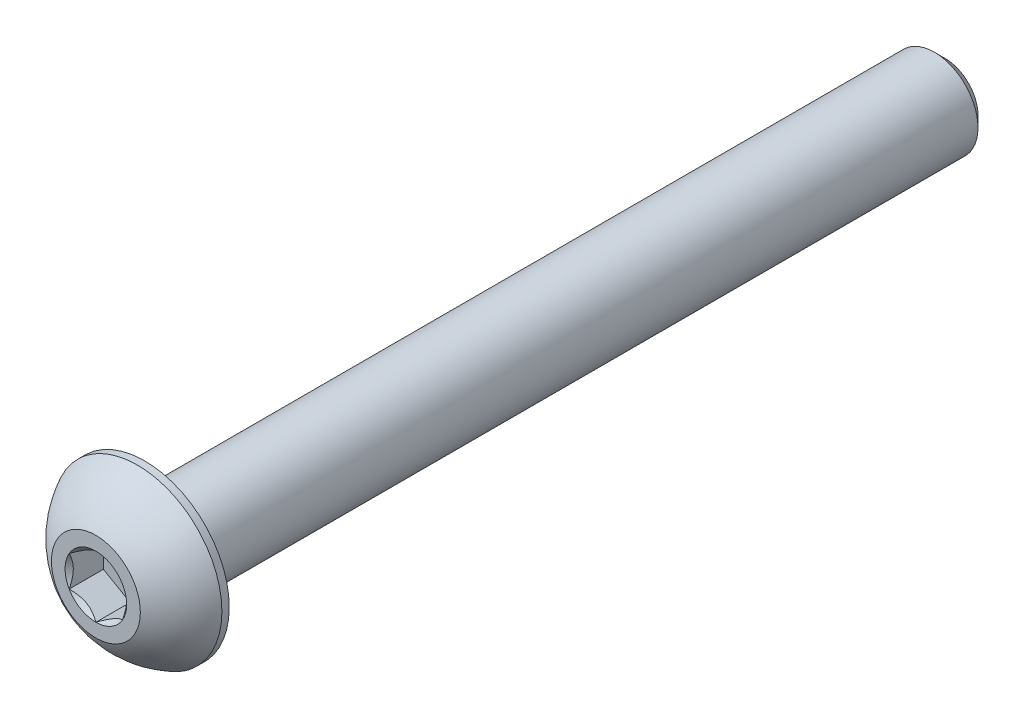
ISO-10303-21;
HEADER;
FILE_DESCRIPTION(('STEP AP214'),'2;1');
FILE_NAME('part.step','',(''),(''),'','','');
FILE_SCHEMA(('AUTOMOTIVE_DESIGN { 1 0 10303 214 1 1 1 1 }'));
ENDSEC;
DATA;
#1=APPLICATION_CONTEXT('core data for automotive mechanical design processes');
#2=APPLICATION_PROTOCOL_DEFINITION('international standard','automotive_design',2000,#1);
#3=PRODUCT_CONTEXT('',#1,'mechanical');
#4=PRODUCT('Part','Part','',(#3));
#5=PRODUCT_RELATED_PRODUCT_CATEGORY('part','',(#4));
#6=PRODUCT_DEFINITION_FORMATION('','',#4);
#7=PRODUCT_DEFINITION_CONTEXT('part definition',#1,'design');
#8=PRODUCT_DEFINITION('design','',#6,#7);
#9=PRODUCT_DEFINITION_SHAPE('','',#8);
#10=(LENGTH_UNIT() NAMED_UNIT(*) SI_UNIT(.MILLI.,.METRE.));
#11=(NAMED_UNIT(*) PLANE_ANGLE_UNIT() SI_UNIT($,.RADIAN.));
#12=(NAMED_UNIT(*) SI_UNIT($,.STERADIAN.) SOLID_ANGLE_UNIT());
#13=UNCERTAINTY_MEASURE_WITH_UNIT(LENGTH_MEASURE(1.E-05),#10,'distance_accuracy_value','');
#14=(GEOMETRIC_REPRESENTATION_CONTEXT(3) GLOBAL_UNCERTAINTY_ASSIGNED_CONTEXT((#13)) GLOBAL_UNIT_ASSIGNED_CONTEXT((#10,
#11,#12)) REPRESENTATION_CONTEXT('',''));
#15=CARTESIAN_POINT('',(0.,0.,0.));
#16=DIRECTION('',(0.,0.,1.));
#17=DIRECTION('',(1.,0.,0.));
#18=AXIS2_PLACEMENT_3D('',#15,#16,#17);
#19=CARTESIAN_POINT('',(1.5,-0.866025403784438,-1.925));
#20=DIRECTION('',(0.,0.,1.));
#21=DIRECTION('',(1.,0.,0.));
#22=AXIS2_PLACEMENT_3D('',#19,#20,#21);
#23=PLANE('',#22);
#24=DIRECTION('',(0.,-1.,0.));
#25=VECTOR('',#24,1.);
#26=CARTESIAN_POINT('',(-1.5,0.866025403784438,-1.925));
#27=LINE('',#26,#25);
#28=CARTESIAN_POINT('',(-1.5,0.866025403784438,-1.925));
#29=VERTEX_POINT('',#28);
#30=CARTESIAN_POINT('',(-1.5,-0.866025403784438,-1.925));
#31=VERTEX_POINT('',#30);
#32=EDGE_CURVE('E67',#29,#31,#27,.T.);
#33=ORIENTED_EDGE('',*,*,#32,.T.);
#34=DIRECTION('',(0.866025403784439,-0.5,0.));
#35=VECTOR('',#34,1.);
#36=CARTESIAN_POINT('',(-1.5,-0.866025403784438,-1.925));
#37=LINE('',#36,#35);
#38=CARTESIAN_POINT('',(0.,-1.73205080756888,-1.925));
#39=VERTEX_POINT('',#38);
#40=EDGE_CURVE('E81',#31,#39,#37,.T.);
#41=ORIENTED_EDGE('',*,*,#40,.T.);
#42=DIRECTION('',(0.866025403784438,0.5,0.));
#43=VECTOR('',#42,1.);
#44=CARTESIAN_POINT('',(0.,-1.73205080756888,-1.925));
#45=LINE('',#44,#43);
#46=CARTESIAN_POINT('',(1.5,-0.866025403784438,-1.925));
#47=VERTEX_POINT('',#46);
#48=EDGE_CURVE('E84',#39,#47,#45,.T.);
#49=ORIENTED_EDGE('',*,*,#48,.T.);
#50=DIRECTION('',(0.,1.,0.));
#51=VECTOR('',#50,1.);
#52=CARTESIAN_POINT('',(1.5,-0.866025403784438,-1.925));
#53=LINE('',#52,#51);
#54=CARTESIAN_POINT('',(1.5,0.866025403784438,-1.925));
#55=VERTEX_POINT('',#54);
#56=EDGE_CURVE('E93',#47,#55,#53,.T.);
#57=ORIENTED_EDGE('',*,*,#56,.T.);
#58=DIRECTION('',(-0.866025403784439,0.5,0.));
#59=VECTOR('',#58,1.);
#60=CARTESIAN_POINT('',(1.5,0.866025403784438,-1.925));
#61=LINE('',#60,#59);
#62=CARTESIAN_POINT('',(0.,1.73205080756888,-1.925));
#63=VERTEX_POINT('',#62);
#64=EDGE_CURVE('E263',#55,#63,#61,.T.);
#65=ORIENTED_EDGE('',*,*,#64,.T.);
#66=DIRECTION('',(-0.866025403784438,-0.5,0.));
#67=VECTOR('',#66,1.);
#68=CARTESIAN_POINT('',(0.,1.73205080756888,-1.925));
#69=LINE('',#68,#67);
#70=EDGE_CURVE('E72',#63,#29,#69,.T.);
#71=ORIENTED_EDGE('',*,*,#70,.T.);
#72=EDGE_LOOP('',(#33,#41,#49,#57,#65,#71));
#73=FACE_BOUND('',#72,.T.);
#74=ADVANCED_FACE('F17',(#73),#23,.T.);
#75=CARTESIAN_POINT('',(-1.5,-0.866025403784438,-1.925));
#76=DIRECTION('',(-0.5,-0.866025403784439,0.));
#77=DIRECTION('',(0.866025403784439,-0.5,0.));
#78=AXIS2_PLACEMENT_3D('',#75,#76,#77);
#79=PLANE('',#78);
#80=CARTESIAN_POINT('',(-1.5000000000006,-0.86602540378409,7.8878760553342E-12));
#81=CARTESIAN_POINT('',(-1.44844426724859,-0.89579111996673,-0.0297371504405389));
#82=CARTESIAN_POINT('',(-1.39602652185215,-0.926054519381678,-0.0577274996872082));
#83=CARTESIAN_POINT('',(-1.28914135976012,-0.987764696487893,-0.108976634246313));
#84=CARTESIAN_POINT('',(-1.23466378383427,-1.01921733961348,-0.132206913874872));
#85=CARTESIAN_POINT('',(-1.12481242362637,-1.08264005200036,-0.172000539010943));
#86=CARTESIAN_POINT('',(-1.06946660010305,-1.11459397811007,-0.188663877302226));
#87=CARTESIAN_POINT('',(-0.957556855323872,-1.17920509938327,-0.214336924336445));
#88=CARTESIAN_POINT('',(-0.900996350286869,-1.21186032219188,-0.223365789852227));
#89=CARTESIAN_POINT('',(-0.80350907283892,-1.26814462806902,-0.231512589284017));
#90=CARTESIAN_POINT('',(-0.762708138137249,-1.29170105870222,-0.232718117487112));
#91=CARTESIAN_POINT('',(-0.68117834074302,-1.33877230917475,-0.23068386176224));
#92=CARTESIAN_POINT('',(-0.640449495960677,-1.36228711867362,-0.227443095877418));
#93=CARTESIAN_POINT('',(-0.559384065198046,-1.4090902669464,-0.216702694649475));
#94=CARTESIAN_POINT('',(-0.519047879500598,-1.4323783746169,-0.209199099036573));
#95=CARTESIAN_POINT('',(-0.439052551254713,-1.47856369891358,-0.190340526331541));
#96=CARTESIAN_POINT('',(-0.399393706905605,-1.50146074337428,-0.1789838966256));
#97=CARTESIAN_POINT('',(-0.297850129663003,-1.56008695502978,-0.145281418525103));
#98=CARTESIAN_POINT('',(-0.236594120191865,-1.59545312858742,-0.12039901641195));
#99=CARTESIAN_POINT('',(-0.146523888906146,-1.6474552008662,-0.0783962697357519));
#100=CARTESIAN_POINT('',(-0.116842951465041,-1.66459149808762,-0.0636393456682642));
#101=CARTESIAN_POINT('',(-0.0580266310422001,-1.69854911651649,-0.032778472034537));
#102=CARTESIAN_POINT('',(-0.0288909964594271,-1.71537058298587,-0.0166751634238462));
#103=CARTESIAN_POINT('',(6.04437737562328E-13,-1.73205080756922,7.88867609053754E-12));
#104=B_SPLINE_CURVE_WITH_KNOTS('',3,(#80,#81,#82,#83,#84,#85,#86,#87,#88,#89,#90,#91,#92,#93,
#94,#95,#96,#97,#98,#99,#100,#101,#102,#103),.UNSPECIFIED.,.F.,.F.,(4,2,2,2,2,2,2,2,2,2,2,4),
(0.,0.199774419903527,0.400712312264434,0.598459990318376,0.795709985681692,0.936894690845066,
1.07811058144176,1.2194578799894,1.36086588093954,1.58533909983583,1.69726364726556,
1.80913521236625),.UNSPECIFIED.);
#105=CARTESIAN_POINT('',(-1.49999999999673,-0.866025403782903,3.94464312733954E-12));
#106=VERTEX_POINT('',#105);
#107=CARTESIAN_POINT('',(6.23161744805802E-12,-1.73205080756528,3.94479537572782E-12));
#108=VERTEX_POINT('',#107);
#109=EDGE_CURVE('E20',#106,#108,#104,.T.);
#110=ORIENTED_EDGE('',*,*,#109,.T.);
#111=DIRECTION('',(0.,0.,1.));
#112=VECTOR('',#111,1.);
#113=CARTESIAN_POINT('',(0.,-1.73205080756888,-1.925));
#114=LINE('',#113,#112);
#115=EDGE_CURVE('E88',#108,#39,#114,.F.);
#116=ORIENTED_EDGE('',*,*,#115,.T.);
#117=ORIENTED_EDGE('',*,*,#40,.F.);
#118=DIRECTION('',(0.,0.,1.));
#119=VECTOR('',#118,1.);
#120=CARTESIAN_POINT('',(-1.5,-0.866025403784438,-1.925));
#121=LINE('',#120,#119);
#122=EDGE_CURVE('E59',#31,#106,#121,.T.);
#123=ORIENTED_EDGE('',*,*,#122,.T.);
#124=EDGE_LOOP('',(#110,#116,#117,#123));
#125=FACE_BOUND('',#124,.T.);
#126=ADVANCED_FACE('F89',(#125),#79,.F.);
#127=CARTESIAN_POINT('',(0.,-1.73205080756888,-1.925));
#128=DIRECTION('',(0.5,-0.866025403784438,0.));
#129=DIRECTION('',(0.866025403784438,0.5,0.));
#130=AXIS2_PLACEMENT_3D('',#127,#128,#129);
#131=PLANE('',#130);
#132=CARTESIAN_POINT('',(-6.00859181248372E-13,-1.73205080756923,7.88959072377341E-12));
#133=CARTESIAN_POINT('',(0.0515557327514054,-1.70228509138659,-0.0297371504405373));
#134=CARTESIAN_POINT('',(0.103973478147846,-1.67202169197164,-0.0577274996872066));
#135=CARTESIAN_POINT('',(0.210858640239885,-1.61031151486542,-0.108976634246312));
#136=CARTESIAN_POINT('',(0.265336216165728,-1.57885887173984,-0.13220691387487));
#137=CARTESIAN_POINT('',(0.375187576373631,-1.51543615935296,-0.172000539010941));
#138=CARTESIAN_POINT('',(0.430533399896951,-1.48348223324325,-0.188663877302224));
#139=CARTESIAN_POINT('',(0.542443144676127,-1.41887111197005,-0.214336924336443));
#140=CARTESIAN_POINT('',(0.599003649713131,-1.38621588916143,-0.223365789852224));
#141=CARTESIAN_POINT('',(0.69649092716108,-1.3299315832843,-0.231512589284015));
#142=CARTESIAN_POINT('',(0.737291861862751,-1.3063751526511,-0.23271811748711));
#143=CARTESIAN_POINT('',(0.81882165925698,-1.25930390217857,-0.230683861762238));
#144=CARTESIAN_POINT('',(0.859550504039322,-1.2357890926797,-0.227443095877416));
#145=CARTESIAN_POINT('',(0.940615934801954,-1.18898594440692,-0.216702694649473));
#146=CARTESIAN_POINT('',(0.980952120499402,-1.16569783673641,-0.209199099036571));
#147=CARTESIAN_POINT('',(1.06094744874529,-1.11951251243974,-0.190340526331538));
#148=CARTESIAN_POINT('',(1.1006062930944,-1.09661546797903,-0.178983896625598));
#149=CARTESIAN_POINT('',(1.202149870337,-1.03798925632354,-0.145281418525101));
#150=CARTESIAN_POINT('',(1.26340587980814,-1.0026230827659,-0.120399016411949));
#151=CARTESIAN_POINT('',(1.35347611109385,-0.950621010487114,-0.0783962697357505));
#152=CARTESIAN_POINT('',(1.38315704853496,-0.933484713265692,-0.0636393456682628));
#153=CARTESIAN_POINT('',(1.4419733689578,-0.899527094836821,-0.0327784720345357));
#154=CARTESIAN_POINT('',(1.47110900354057,-0.882705628367447,-0.0166751634238451));
#155=CARTESIAN_POINT('',(1.5000000000006,-0.866025403784091,7.88950923560866E-12));
#156=B_SPLINE_CURVE_WITH_KNOTS('',3,(#132,#133,#134,#135,#136,#137,#138,#139,#140,#141,#142,
#143,#144,#145,#146,#147,#148,#149,#150,#151,#152,#153,#154,#155),.UNSPECIFIED.,.F.,.F.,(4,2,2,
2,2,2,2,2,2,2,2,4),(0.,0.199774419903527,0.400712312264434,0.598459990318375,0.795709985681691,
0.936894690845065,1.07811058144176,1.2194578799894,1.36086588093954,1.58533909983583,
1.69726364726556,1.80913521236625),.UNSPECIFIED.);
#157=CARTESIAN_POINT('',(1.5,-0.866025403777246,3.94413477082877E-12));
#158=VERTEX_POINT('',#157);
#159=EDGE_CURVE('E202',#108,#158,#156,.T.);
#160=ORIENTED_EDGE('',*,*,#159,.T.);
#161=DIRECTION('',(0.,0.,-1.));
#162=VECTOR('',#161,1.);
#163=CARTESIAN_POINT('',(1.5,-0.866025403784438,-1.925));
#164=LINE('',#163,#162);
#165=EDGE_CURVE('E97',#158,#47,#164,.T.);
#166=ORIENTED_EDGE('',*,*,#165,.T.);
#167=ORIENTED_EDGE('',*,*,#48,.F.);
#168=ORIENTED_EDGE('',*,*,#115,.F.);
#169=EDGE_LOOP('',(#160,#166,#167,#168));
#170=FACE_BOUND('',#169,.T.);
#171=ADVANCED_FACE('F95',(#170),#131,.F.);
#172=CARTESIAN_POINT('',(1.5,-0.866025403784438,-1.925));
#173=DIRECTION('',(1.,0.,0.));
#174=DIRECTION('',(0.,0.,-1.));
#175=AXIS2_PLACEMENT_3D('',#172,#173,#174);
#176=PLANE('',#175);
#177=CARTESIAN_POINT('',(1.5,-0.866025403785134,7.88836096311259E-12));
#178=CARTESIAN_POINT('',(1.5,-0.806493971432377,-0.0297371504415117));
#179=CARTESIAN_POINT('',(1.5,-0.745967172615079,-0.0577274996896699));
#180=CARTESIAN_POINT('',(1.5,-0.622546818427832,-0.10897663425314));
#181=CARTESIAN_POINT('',(1.5,-0.559641532189249,-0.132206913884579));
#182=CARTESIAN_POINT('',(1.5,-0.432796107439993,-0.17200053902811));
#183=CARTESIAN_POINT('',(1.5,-0.368888255232488,-0.188663877323922));
#184=CARTESIAN_POINT('',(1.5,-0.239666012709307,-0.214336924368776));
#185=CARTESIAN_POINT('',(1.5,-0.174355567103383,-0.223365789890661));
#186=CARTESIAN_POINT('',(1.5,-0.0617869553753179,-0.231512589333309));
#187=CARTESIAN_POINT('',(1.5,-0.0146740941240909,-0.2327181175416));
#188=CARTESIAN_POINT('',(1.5,0.0794684067912049,-0.230683861828798));
#189=CARTESIAN_POINT('',(1.5,0.126498025774339,-0.22744309595085));
#190=CARTESIAN_POINT('',(1.5,0.220104322291359,-0.216702694737869));
#191=CARTESIAN_POINT('',(1.5,0.266680537618435,-0.209199099133056));
#192=CARTESIAN_POINT('',(1.5,0.359051186184533,-0.190340526444922));
#193=CARTESIAN_POINT('',(1.5,0.404845275092631,-0.178983896747791));
#194=CARTESIAN_POINT('',(1.5,0.522097698447671,-0.145281418648099));
#195=CARTESIAN_POINT('',(1.5,0.59283004561811,-0.120399016518066));
#196=CARTESIAN_POINT('',(1.5,0.696834190254606,-0.0783962698077877));
#197=CARTESIAN_POINT('',(1.5,0.731106784723212,-0.0636393457274447));
#198=CARTESIAN_POINT('',(1.5,0.799022021631199,-0.0327784720657137));
#199=CARTESIAN_POINT('',(1.5,0.832664954594435,-0.0166751634398797));
#200=CARTESIAN_POINT('',(1.5,0.866025403785134,7.88833476156348E-12));
#201=B_SPLINE_CURVE_WITH_KNOTS('',3,(#177,#178,#179,#180,#181,#182,#183,#184,#185,#186,#187,
#188,#189,#190,#191,#192,#193,#194,#195,#196,#197,#198,#199,#200),.UNSPECIFIED.,.F.,.F.,(4,2,2,
2,2,2,2,2,2,2,2,4),(0.,0.199774419871185,0.400712312199741,0.598459990222632,0.795709985554923,
0.936894690673307,1.07811058122496,1.2194578797275,1.36086588063252,1.58533909970013,
1.69726364721605,1.80913521240256),.UNSPECIFIED.);
#202=CARTESIAN_POINT('',(1.49999999999377,0.866025403788034,3.94426851365226E-12));
#203=VERTEX_POINT('',#202);
#204=EDGE_CURVE('E184',#158,#203,#201,.T.);
#205=ORIENTED_EDGE('',*,*,#204,.T.);
#206=DIRECTION('',(0.,0.,1.));
#207=VECTOR('',#206,1.);
#208=CARTESIAN_POINT('',(1.5,0.866025403784438,-1.925));
#209=LINE('',#208,#207);
#210=EDGE_CURVE('E260',#203,#55,#209,.F.);
#211=ORIENTED_EDGE('',*,*,#210,.T.);
#212=ORIENTED_EDGE('',*,*,#56,.F.);
#213=ORIENTED_EDGE('',*,*,#165,.F.);
#214=EDGE_LOOP('',(#205,#211,#212,#213));
#215=FACE_BOUND('',#214,.T.);
#216=ADVANCED_FACE('F174',(#215),#176,.F.);
#217=CARTESIAN_POINT('',(1.5,0.866025403784438,-1.925));
#218=DIRECTION('',(0.5,0.866025403784439,0.));
#219=DIRECTION('',(-0.866025403784439,0.5,0.));
#220=AXIS2_PLACEMENT_3D('',#217,#218,#219);
#221=PLANE('',#220);
#222=CARTESIAN_POINT('',(1.5000000000006,0.86602540378409,7.88852728098798E-12));
#223=CARTESIAN_POINT('',(1.4484442672486,0.895791119966729,-0.0297371504405387));
#224=CARTESIAN_POINT('',(1.39602652185216,0.926054519381677,-0.057727499687208));
#225=CARTESIAN_POINT('',(1.28914135976012,0.987764696487892,-0.108976634246313));
#226=CARTESIAN_POINT('',(1.23466378383427,1.01921733961348,-0.132206913874872));
#227=CARTESIAN_POINT('',(1.12481242362637,1.08264005200036,-0.172000539010943));
#228=CARTESIAN_POINT('',(1.06946660010305,1.11459397811007,-0.188663877302226));
#229=CARTESIAN_POINT('',(0.957556855323873,1.17920509938327,-0.214336924336445));
#230=CARTESIAN_POINT('',(0.900996350286869,1.21186032219188,-0.223365789852227));
#231=CARTESIAN_POINT('',(0.80350907283892,1.26814462806902,-0.231512589284017));
#232=CARTESIAN_POINT('',(0.762708138137249,1.29170105870222,-0.232718117487112));
#233=CARTESIAN_POINT('',(0.68117834074302,1.33877230917475,-0.23068386176224));
#234=CARTESIAN_POINT('',(0.640449495960677,1.36228711867362,-0.227443095877418));
#235=CARTESIAN_POINT('',(0.559384065198046,1.4090902669464,-0.216702694649475));
#236=CARTESIAN_POINT('',(0.519047879500598,1.4323783746169,-0.209199099036573));
#237=CARTESIAN_POINT('',(0.439052551254713,1.47856369891358,-0.190340526331541));
#238=CARTESIAN_POINT('',(0.399393706905604,1.50146074337428,-0.1789838966256));
#239=CARTESIAN_POINT('',(0.297850129663003,1.56008695502978,-0.145281418525103));
#240=CARTESIAN_POINT('',(0.236594120191865,1.59545312858742,-0.12039901641195));
#241=CARTESIAN_POINT('',(0.146523888906147,1.6474552008662,-0.0783962697357523));
#242=CARTESIAN_POINT('',(0.116842951465042,1.66459149808762,-0.0636393456682646));
#243=CARTESIAN_POINT('',(0.0580266310422008,1.69854911651649,-0.0327784720345375));
#244=CARTESIAN_POINT('',(0.0288909964594279,1.71537058298587,-0.0166751634238467));
#245=CARTESIAN_POINT('',(-6.03575848693314E-13,1.73205080756922,7.88812502537333E-12));
#246=B_SPLINE_CURVE_WITH_KNOTS('',3,(#222,#223,#224,#225,#226,#227,#228,#229,#230,#231,#232,
#233,#234,#235,#236,#237,#238,#239,#240,#241,#242,#243,#244,#245),.UNSPECIFIED.,.F.,.F.,(4,2,2,
2,2,2,2,2,2,2,2,4),(0.,0.199774419903527,0.400712312264434,0.598459990318376,0.795709985681693,
0.936894690845067,1.07811058144176,1.21945787998941,1.36086588093954,1.58533909983583,
1.69726364726556,1.80913521236625),.UNSPECIFIED.);
#247=CARTESIAN_POINT('',(-6.2306414692626E-12,1.73205080756528,3.9448391496264E-12));
#248=VERTEX_POINT('',#247);
#249=EDGE_CURVE('E178',#203,#248,#246,.T.);
#250=ORIENTED_EDGE('',*,*,#249,.T.);
#251=DIRECTION('',(0.,0.,1.));
#252=VECTOR('',#251,1.);
#253=CARTESIAN_POINT('',(0.,1.73205080756888,-1.925));
#254=LINE('',#253,#252);
#255=EDGE_CURVE('E255',#248,#63,#254,.F.);
#256=ORIENTED_EDGE('',*,*,#255,.T.);
#257=ORIENTED_EDGE('',*,*,#64,.F.);
#258=ORIENTED_EDGE('',*,*,#210,.F.);
#259=EDGE_LOOP('',(#250,#256,#257,#258));
#260=FACE_BOUND('',#259,.T.);
#261=ADVANCED_FACE('F170',(#260),#221,.F.);
#262=CARTESIAN_POINT('',(0.,1.73205080756888,-1.925));
#263=DIRECTION('',(-0.5,0.866025403784438,0.));
#264=DIRECTION('',(-0.866025403784438,-0.5,0.));
#265=AXIS2_PLACEMENT_3D('',#262,#263,#264);
#266=PLANE('',#265);
#267=CARTESIAN_POINT('',(6.0194377710121E-13,1.73205080756923,7.88967827157055E-12));
#268=CARTESIAN_POINT('',(-0.0515557327514043,1.70228509138659,-0.0297371504405374));
#269=CARTESIAN_POINT('',(-0.103973478147845,1.67202169197164,-0.0577274996872066));
#270=CARTESIAN_POINT('',(-0.210858640239883,1.61031151486542,-0.108976634246312));
#271=CARTESIAN_POINT('',(-0.265336216165727,1.57885887173984,-0.13220691387487));
#272=CARTESIAN_POINT('',(-0.37518757637363,1.51543615935296,-0.172000539010941));
#273=CARTESIAN_POINT('',(-0.430533399896949,1.48348223324325,-0.188663877302224));
#274=CARTESIAN_POINT('',(-0.542443144676126,1.41887111197005,-0.214336924336443));
#275=CARTESIAN_POINT('',(-0.599003649713129,1.38621588916143,-0.223365789852225));
#276=CARTESIAN_POINT('',(-0.696490927161079,1.3299315832843,-0.231512589284016));
#277=CARTESIAN_POINT('',(-0.73729186186275,1.3063751526511,-0.23271811748711));
#278=CARTESIAN_POINT('',(-0.818821659256978,1.25930390217857,-0.230683861762239));
#279=CARTESIAN_POINT('',(-0.859550504039321,1.2357890926797,-0.227443095877417));
#280=CARTESIAN_POINT('',(-0.940615934801952,1.18898594440692,-0.216702694649474));
#281=CARTESIAN_POINT('',(-0.980952120499401,1.16569783673641,-0.209199099036572));
#282=CARTESIAN_POINT('',(-1.06094744874529,1.11951251243974,-0.190340526331539));
#283=CARTESIAN_POINT('',(-1.10060629309439,1.09661546797903,-0.178983896625599));
#284=CARTESIAN_POINT('',(-1.202149870337,1.03798925632354,-0.145281418525102));
#285=CARTESIAN_POINT('',(-1.26340587980813,1.0026230827659,-0.120399016411949));
#286=CARTESIAN_POINT('',(-1.35347611109385,0.950621010487114,-0.078396269735751));
#287=CARTESIAN_POINT('',(-1.38315704853496,0.933484713265692,-0.0636393456682632));
#288=CARTESIAN_POINT('',(-1.4419733689578,0.899527094836821,-0.0327784720345361));
#289=CARTESIAN_POINT('',(-1.47110900354057,0.882705628367447,-0.0166751634238454));
#290=CARTESIAN_POINT('',(-1.5000000000006,0.866025403784091,7.8892092296245E-12));
#291=B_SPLINE_CURVE_WITH_KNOTS('',3,(#267,#268,#269,#270,#271,#272,#273,#274,#275,#276,#277,
#278,#279,#280,#281,#282,#283,#284,#285,#286,#287,#288,#289,#290),.UNSPECIFIED.,.F.,.F.,(4,2,2,
2,2,2,2,2,2,2,2,4),(0.,0.199774419903527,0.400712312264434,0.598459990318375,0.795709985681692,
0.936894690845065,1.07811058144176,1.2194578799894,1.36086588093954,1.58533909983583,
1.69726364726556,1.80913521236625),.UNSPECIFIED.);
#292=CARTESIAN_POINT('',(-1.5,0.866025403777246,3.94413477082877E-12));
#293=VERTEX_POINT('',#292);
#294=EDGE_CURVE('E40',#248,#293,#291,.T.);
#295=ORIENTED_EDGE('',*,*,#294,.T.);
#296=DIRECTION('',(0.,0.,1.));
#297=VECTOR('',#296,1.);
#298=CARTESIAN_POINT('',(-1.5,0.866025403784438,-1.925));
#299=LINE('',#298,#297);
#300=EDGE_CURVE('E248',#293,#29,#299,.F.);
#301=ORIENTED_EDGE('',*,*,#300,.T.);
#302=ORIENTED_EDGE('',*,*,#70,.F.);
#303=ORIENTED_EDGE('',*,*,#255,.F.);
#304=EDGE_LOOP('',(#295,#301,#302,#303));
#305=FACE_BOUND('',#304,.T.);
#306=ADVANCED_FACE('F163',(#305),#266,.F.);
#307=CARTESIAN_POINT('',(-1.5,0.866025403784438,-1.925));
#308=DIRECTION('',(-1.,0.,0.));
#309=DIRECTION('',(0.,-1.,0.));
#310=AXIS2_PLACEMENT_3D('',#307,#308,#309);
#311=PLANE('',#310);
#312=CARTESIAN_POINT('',(-1.5,0.866025403785134,7.88836096311259E-12));
#313=CARTESIAN_POINT('',(-1.5,0.806493971432377,-0.0297371504415118));
#314=CARTESIAN_POINT('',(-1.5,0.745967172615078,-0.0577274996896699));
#315=CARTESIAN_POINT('',(-1.5,0.622546818427832,-0.10897663425314));
#316=CARTESIAN_POINT('',(-1.5,0.559641532189249,-0.132206913884579));
#317=CARTESIAN_POINT('',(-1.5,0.432796107439993,-0.17200053902811));
#318=CARTESIAN_POINT('',(-1.5,0.368888255232488,-0.188663877323922));
#319=CARTESIAN_POINT('',(-1.5,0.239666012709307,-0.214336924368776));
#320=CARTESIAN_POINT('',(-1.5,0.174355567103383,-0.223365789890661));
#321=CARTESIAN_POINT('',(-1.5,0.0617869553753176,-0.231512589333309));
#322=CARTESIAN_POINT('',(-1.5,0.0146740941240907,-0.2327181175416));
#323=CARTESIAN_POINT('',(-1.5,-0.0794684067912052,-0.230683861828798));
#324=CARTESIAN_POINT('',(-1.5,-0.12649802577434,-0.22744309595085));
#325=CARTESIAN_POINT('',(-1.5,-0.220104322291359,-0.216702694737869));
#326=CARTESIAN_POINT('',(-1.5,-0.266680537618435,-0.209199099133056));
#327=CARTESIAN_POINT('',(-1.5,-0.359051186184533,-0.190340526444922));
#328=CARTESIAN_POINT('',(-1.5,-0.404845275092631,-0.178983896747791));
#329=CARTESIAN_POINT('',(-1.5,-0.522097698447671,-0.145281418648099));
#330=CARTESIAN_POINT('',(-1.5,-0.59283004561811,-0.120399016518066));
#331=CARTESIAN_POINT('',(-1.5,-0.696834190254606,-0.0783962698077872));
#332=CARTESIAN_POINT('',(-1.5,-0.731106784723212,-0.0636393457274441));
#333=CARTESIAN_POINT('',(-1.5,-0.7990220216312,-0.0327784720657131));
#334=CARTESIAN_POINT('',(-1.5,-0.832664954594437,-0.016675163439879));
#335=CARTESIAN_POINT('',(-1.5,-0.866025403785135,7.88920137365412E-12));
#336=B_SPLINE_CURVE_WITH_KNOTS('',3,(#312,#313,#314,#315,#316,#317,#318,#319,#320,#321,#322,
#323,#324,#325,#326,#327,#328,#329,#330,#331,#332,#333,#334,#335),.UNSPECIFIED.,.F.,.F.,(4,2,2,
2,2,2,2,2,2,2,2,4),(0.,0.199774419871185,0.400712312199741,0.598459990222632,0.795709985554923,
0.936894690673308,1.07811058122496,1.2194578797275,1.36086588063252,1.58533909970013,
1.69726364721605,1.80913521240256),.UNSPECIFIED.);
#337=EDGE_CURVE('E143',#293,#106,#336,.T.);
#338=ORIENTED_EDGE('',*,*,#337,.T.);
#339=ORIENTED_EDGE('',*,*,#122,.F.);
#340=ORIENTED_EDGE('',*,*,#32,.F.);
#341=ORIENTED_EDGE('',*,*,#300,.F.);
#342=EDGE_LOOP('',(#338,#339,#340,#341));
#343=FACE_BOUND('',#342,.T.);
#344=ADVANCED_FACE('F159',(#343),#311,.F.);
#345=CARTESIAN_POINT('',(0.,0.,1.13686837721616E-10));
#346=DIRECTION('',(0.,0.,1.));
#347=DIRECTION('',(1.,0.,0.));
#348=AXIS2_PLACEMENT_3D('',#345,#346,#347);
#349=CONICAL_SURFACE('',#348,1.73205080767502,0.785398163519197);
#350=ORIENTED_EDGE('',*,*,#109,.F.);
#351=CARTESIAN_POINT('',(0.,0.,0.));
#352=DIRECTION('',(0.,0.,1.));
#353=DIRECTION('',(1.,0.,0.));
#354=AXIS2_PLACEMENT_3D('',#351,#352,#353);
#355=CIRCLE('',#354,1.73205080756134);
#356=EDGE_CURVE('E151',#106,#108,#355,.T.);
#357=ORIENTED_EDGE('',*,*,#356,.T.);
#358=EDGE_LOOP('',(#350,#357));
#359=FACE_BOUND('',#358,.T.);
#360=ADVANCED_FACE('F162',(#359),#349,.F.);
#361=CARTESIAN_POINT('',(0.,0.,1.13686837721616E-10));
#362=DIRECTION('',(0.,0.,1.));
#363=DIRECTION('',(1.,0.,0.));
#364=AXIS2_PLACEMENT_3D('',#361,#362,#363);
#365=CONICAL_SURFACE('',#364,1.73205080767502,0.785398163519197);
#366=ORIENTED_EDGE('',*,*,#159,.F.);
#367=CARTESIAN_POINT('',(0.,0.,0.));
#368=DIRECTION('',(0.,0.,1.));
#369=DIRECTION('',(1.,0.,0.));
#370=AXIS2_PLACEMENT_3D('',#367,#368,#369);
#371=CIRCLE('',#370,1.73205080756134);
#372=EDGE_CURVE('E301',#108,#158,#371,.T.);
#373=ORIENTED_EDGE('',*,*,#372,.T.);
#374=EDGE_LOOP('',(#366,#373));
#375=FACE_BOUND('',#374,.T.);
#376=ADVANCED_FACE('F197',(#375),#365,.F.);
#377=CARTESIAN_POINT('',(0.,0.,1.13686837721616E-10));
#378=DIRECTION('',(0.,0.,1.));
#379=DIRECTION('',(1.,0.,0.));
#380=AXIS2_PLACEMENT_3D('',#377,#378,#379);
#381=CONICAL_SURFACE('',#380,1.73205080767502,0.785398163397448);
#382=CARTESIAN_POINT('',(0.,0.,0.));
#383=DIRECTION('',(0.,0.,1.));
#384=DIRECTION('',(1.,0.,0.));
#385=AXIS2_PLACEMENT_3D('',#382,#383,#384);
#386=CIRCLE('',#385,1.73205080756134);
#387=EDGE_CURVE('E302',#158,#203,#386,.T.);
#388=ORIENTED_EDGE('',*,*,#387,.T.);
#389=ORIENTED_EDGE('',*,*,#204,.F.);
#390=EDGE_LOOP('',(#388,#389));
#391=FACE_BOUND('',#390,.T.);
#392=ADVANCED_FACE('F193',(#391),#381,.F.);
#393=CARTESIAN_POINT('',(0.,0.,1.13686837721616E-10));
#394=DIRECTION('',(0.,0.,1.));
#395=DIRECTION('',(1.,0.,0.));
#396=AXIS2_PLACEMENT_3D('',#393,#394,#395);
#397=CONICAL_SURFACE('',#396,1.73205080767502,0.785398163519197);
#398=ORIENTED_EDGE('',*,*,#249,.F.);
#399=CARTESIAN_POINT('',(0.,0.,0.));
#400=DIRECTION('',(0.,0.,1.));
#401=DIRECTION('',(1.,0.,0.));
#402=AXIS2_PLACEMENT_3D('',#399,#400,#401);
#403=CIRCLE('',#402,1.73205080756134);
#404=EDGE_CURVE('E303',#203,#248,#403,.T.);
#405=ORIENTED_EDGE('',*,*,#404,.T.);
#406=EDGE_LOOP('',(#398,#405));
#407=FACE_BOUND('',#406,.T.);
#408=ADVANCED_FACE('F190',(#407),#397,.F.);
#409=CARTESIAN_POINT('',(0.,0.,1.13686837721616E-10));
#410=DIRECTION('',(0.,0.,1.));
#411=DIRECTION('',(1.,0.,0.));
#412=AXIS2_PLACEMENT_3D('',#409,#410,#411);
#413=CONICAL_SURFACE('',#412,1.73205080767502,0.785398163519197);
#414=ORIENTED_EDGE('',*,*,#294,.F.);
#415=CARTESIAN_POINT('',(0.,0.,0.));
#416=DIRECTION('',(0.,0.,1.));
#417=DIRECTION('',(1.,0.,0.));
#418=AXIS2_PLACEMENT_3D('',#415,#416,#417);
#419=CIRCLE('',#418,1.73205080756134);
#420=EDGE_CURVE('E296',#248,#293,#419,.T.);
#421=ORIENTED_EDGE('',*,*,#420,.T.);
#422=EDGE_LOOP('',(#414,#421));
#423=FACE_BOUND('',#422,.T.);
#424=ADVANCED_FACE('F138',(#423),#413,.F.);
#425=CARTESIAN_POINT('',(0.,0.,1.13686837721616E-10));
#426=DIRECTION('',(0.,0.,1.));
#427=DIRECTION('',(1.,0.,0.));
#428=AXIS2_PLACEMENT_3D('',#425,#426,#427);
#429=CONICAL_SURFACE('',#428,1.73205080767502,0.785398163397448);
#430=ORIENTED_EDGE('',*,*,#337,.F.);
#431=CARTESIAN_POINT('',(0.,0.,0.));
#432=DIRECTION('',(0.,0.,1.));
#433=DIRECTION('',(1.,0.,0.));
#434=AXIS2_PLACEMENT_3D('',#431,#432,#433);
#435=CIRCLE('',#434,1.73205080756134);
#436=EDGE_CURVE('E123',#293,#106,#435,.T.);
#437=ORIENTED_EDGE('',*,*,#436,.T.);
#438=EDGE_LOOP('',(#430,#437));
#439=FACE_BOUND('',#438,.T.);
#440=ADVANCED_FACE('F133',(#439),#429,.F.);
#441=CARTESIAN_POINT('',(0.,-2.5,0.));
#442=DIRECTION('',(0.,0.,-1.));
#443=DIRECTION('',(-1.,0.,0.));
#444=AXIS2_PLACEMENT_3D('',#441,#442,#443);
#445=PLANE('',#444);
#446=ORIENTED_EDGE('',*,*,#420,.F.);
#447=ORIENTED_EDGE('',*,*,#404,.F.);
#448=ORIENTED_EDGE('',*,*,#387,.F.);
#449=ORIENTED_EDGE('',*,*,#372,.F.);
#450=ORIENTED_EDGE('',*,*,#356,.F.);
#451=ORIENTED_EDGE('',*,*,#436,.F.);
#452=EDGE_LOOP('',(#446,#447,#448,#449,#450,#451));
#453=FACE_BOUND('',#452,.T.);
#454=CARTESIAN_POINT('',(0.,2.50000000000001,0.));
#455=CARTESIAN_POINT('',(-0.14042610491617,2.49999377288615,0.));
#456=CARTESIAN_POINT('',(-0.280954031991962,2.48812860484106,3.15909401556148E-13));
#457=CARTESIAN_POINT('',(-0.558139658492381,2.44096074902969,-3.16289845517051E-13));
#458=CARTESIAN_POINT('',(-0.694792493265143,2.40562985309161,-1.19946589674608E-12));
#459=CARTESIAN_POINT('',(-0.960172122561446,2.31253633023374,-1.20139093455104E-12));
#460=CARTESIAN_POINT('',(-1.08890266852496,2.25478441650809,-3.20981761643939E-13));
#461=CARTESIAN_POINT('',(-1.33480476215494,2.11850293856875,3.20902002578049E-13));
#462=CARTESIAN_POINT('',(-1.45197917410754,2.03997854084976,0.));
#463=CARTESIAN_POINT('',(-1.67149637287936,1.86436525899233,0.));
#464=CARTESIAN_POINT('',(-1.77383760642256,1.76727443311113,0.));
#465=CARTESIAN_POINT('',(-1.96077108972062,1.5572853703438,0.));
#466=CARTESIAN_POINT('',(-2.04536264247664,1.44438651299413,0.));
#467=CARTESIAN_POINT('',(-2.19438926048053,1.20599153577205,0.));
#468=CARTESIAN_POINT('',(-2.2588247010994,1.08049565055392,0.));
#469=CARTESIAN_POINT('',(-2.36571190425967,0.820467575206642,0.));
#470=CARTESIAN_POINT('',(-2.40816371100576,0.685935403248266,0.));
#471=CARTESIAN_POINT('',(-2.46987884513361,0.411653235766081,0.));
#472=CARTESIAN_POINT('',(-2.4891421283097,0.271903230295727,0.));
#473=CARTESIAN_POINT('',(-2.50393321907299,-0.00884700938585608,0.));
#474=CARTESIAN_POINT('',(-2.49946106942908,-0.149847241343843,0.));
#475=CARTESIAN_POINT('',(-2.46690834048228,-0.429095661105701,0.));
#476=CARTESIAN_POINT('',(-2.43882775236998,-0.567343847882636,0.));
#477=CARTESIAN_POINT('',(-2.35985521676827,-0.837163810231989,0.));
#478=CARTESIAN_POINT('',(-2.30896324519902,-0.96873557875657,0.));
#479=CARTESIAN_POINT('',(-2.18581263152619,-1.22146756661809,0.));
#480=CARTESIAN_POINT('',(-2.11355399637579,-1.34262778934316,0.));
#481=CARTESIAN_POINT('',(-1.94972129370707,-1.57109730355803,0.));
#482=CARTESIAN_POINT('',(-1.85814723400701,-1.67840660065421,0.));
#483=CARTESIAN_POINT('',(-1.65828316813495,-1.87612814061527,0.));
#484=CARTESIAN_POINT('',(-1.54999315967219,-1.96654038116455,0.));
#485=CARTESIAN_POINT('',(-1.31977122488188,-2.12790126296045,0.));
#486=CARTESIAN_POINT('',(-1.19783929677157,-2.1988499016635,0.));
#487=CARTESIAN_POINT('',(-0.943794829063065,-2.31926953799948,0.));
#488=CARTESIAN_POINT('',(-0.811682289900769,-2.36874053655201,0.));
#489=CARTESIAN_POINT('',(-0.54102688833753,-2.44480055905628,0.));
#490=CARTESIAN_POINT('',(-0.402484026226279,-2.47138958403887,0.));
#491=CARTESIAN_POINT('',(-0.122900797575727,-2.50093087897621,0.));
#492=CARTESIAN_POINT('',(0.0181395689635707,-2.50388314893098,3.46926385822157E-13));
#493=CARTESIAN_POINT('',(0.298714091660323,-2.48606712714886,-3.46926401451402E-13));
#494=CARTESIAN_POINT('',(0.438248247749922,-2.46529883434334,-1.29314446998388E-12));
#495=CARTESIAN_POINT('',(0.711849384339789,-2.40063123468836,-1.13546839300803E-12));
#496=CARTESIAN_POINT('',(0.845916364605969,-2.3567319268485,0.));
#497=CARTESIAN_POINT('',(1.10477735834655,-2.24704847617179,0.));
#498=CARTESIAN_POINT('',(1.22957137303277,-2.18126433619494,-1.0091714821137E-12));
#499=CARTESIAN_POINT('',(1.46634390401786,-2.02967864834022,-1.18351897957468E-12));
#500=CARTESIAN_POINT('',(1.57832242207296,-1.94387710320555,-3.17121100683944E-13));
#501=CARTESIAN_POINT('',(1.7862852822064,-1.7546922142879,3.17121229043972E-13));
#502=CARTESIAN_POINT('',(1.88226961781081,-1.6513088633884,0.));
#503=CARTESIAN_POINT('',(2.0555193719421,-1.42989510132749,0.));
#504=CARTESIAN_POINT('',(2.13278478437747,-1.31186468539964,0.));
#505=CARTESIAN_POINT('',(2.2664032406088,-1.06450749101074,0.));
#506=CARTESIAN_POINT('',(2.32275630647994,-0.93518072447436,0.));
#507=CARTESIAN_POINT('',(2.41295047224872,-0.66890197473523,0.));
#508=CARTESIAN_POINT('',(2.4467915805466,-0.531949994377825,0.));
#509=CARTESIAN_POINT('',(2.49100125494042,-0.254308178115884,0.));
#510=CARTESIAN_POINT('',(2.50136977874099,-0.113618335476539,0.));
#511=CARTESIAN_POINT('',(2.49833983643023,0.167504919749227,0.));
#512=CARTESIAN_POINT('',(2.48494141562714,0.307938332823984,0.));
#513=CARTESIAN_POINT('',(2.43475793877014,0.584562794538375,0.));
#514=CARTESIAN_POINT('',(2.39797283569016,0.720753834646847,0.));
#515=CARTESIAN_POINT('',(2.30205936796063,0.985029646530049,0.));
#516=CARTESIAN_POINT('',(2.24293058718861,1.1131142672812,0.));
#517=CARTESIAN_POINT('',(2.10401075902967,1.3575336098139,0.));
#518=CARTESIAN_POINT('',(2.02422052292125,1.47386879269155,0.));
#519=CARTESIAN_POINT('',(1.84625229096995,1.69148114008358,0.));
#520=CARTESIAN_POINT('',(1.74807621990901,1.79275987884252,0.));
#521=CARTESIAN_POINT('',(1.53608575842464,1.97742315380663,0.));
#522=CARTESIAN_POINT('',(1.42226748721669,2.06080323621403,0.));
#523=CARTESIAN_POINT('',(1.18220372565671,2.20730286771332,0.));
#524=CARTESIAN_POINT('',(1.05595232774905,2.27041272419885,0.));
#525=CARTESIAN_POINT('',(0.79474524318476,2.37446817640477,0.));
#526=CARTESIAN_POINT('',(0.659800208998089,2.41544034072841,0.));
#527=CARTESIAN_POINT('',(0.436662637238998,2.46313736176947,0.));
#528=CARTESIAN_POINT('',(0.349919997758221,2.47694359911887,0.));
#529=CARTESIAN_POINT('',(0.175464826042706,2.49537686389633,0.));
#530=CARTESIAN_POINT('',(0.0877522938079666,2.50000389132438,0.));
#531=CARTESIAN_POINT('',(0.,2.50000000000001,0.));
#532=B_SPLINE_CURVE_WITH_KNOTS('',3,(#454,#455,#456,#457,#458,#459,#460,#461,#462,#463,#464,
#465,#466,#467,#468,#469,#470,#471,#472,#473,#474,#475,#476,#477,#478,#479,#480,#481,#482,#483,
#484,#485,#486,#487,#488,#489,#490,#491,#492,#493,#494,#495,#496,#497,#498,#499,#500,#501,#502,
#503,#504,#505,#506,#507,#508,#509,#510,#511,#512,#513,#514,#515,#516,#517,#518,#519,#520,#521,
#522,#523,#524,#525,#526,#527,#528,#529,#530,#531),.UNSPECIFIED.,.T.,.F.,(4,2,2,2,2,2,2,2,2,2,2,
2,2,2,2,2,2,2,2,2,2,2,2,2,2,2,2,2,2,2,2,2,2,2,2,2,2,2,4),(0.,0.420958019059747,
0.842422990224611,1.26368682467408,1.68484598149402,2.10604920874208,2.52726897280856,
2.94848089195443,3.36969196412426,3.7909038392729,4.21211495543997,4.63332622878055,
5.05453794675567,5.47574952765962,5.89696093807137,6.31817240620662,6.73938392938707,
7.16059543453284,7.58180692070278,8.00301840687236,8.42422991201778,8.84544143519829,
9.26665290333357,9.68786431374594,10.1090758946506,10.5302876126258,10.9514988859663,
11.3727100021334,11.793921877282,12.2151329494518,12.6363448685977,13.0575646326643,
13.4787678599123,13.8999270167319,14.3211908511815,14.742655822347,15.1636138414069,
15.4266705700074,15.6897272986079),.UNSPECIFIED.);
#533=CARTESIAN_POINT('',(0.,2.50000000000001,0.));
#534=VERTEX_POINT('',#533);
#535=EDGE_CURVE('E115',#534,#534,#532,.F.);
#536=ORIENTED_EDGE('',*,*,#535,.F.);
#537=EDGE_LOOP('',(#536));
#538=FACE_BOUND('',#537,.T.);
#539=ADVANCED_FACE('F129',(#453,#538),#445,.F.);
#540=CARTESIAN_POINT('',(0.,0.,-4.65805481283423));
#541=DIRECTION('',(0.,-1.,0.));
#542=DIRECTION('',(0.,0.,-1.));
#543=AXIS2_PLACEMENT_3D('',#540,#541,#542);
#544=SPHERICAL_SURFACE('',#543,5.28653711226622);
#545=ORIENTED_EDGE('',*,*,#535,.T.);
#546=EDGE_LOOP('',(#545));
#547=FACE_BOUND('',#546,.T.);
#548=CARTESIAN_POINT('',(0.,0.,-2.3375));
#549=DIRECTION('',(0.,0.,1.));
#550=DIRECTION('',(1.,0.,0.));
#551=AXIS2_PLACEMENT_3D('',#548,#549,#550);
#552=CIRCLE('',#551,4.75);
#553=CARTESIAN_POINT('',(4.75,0.,-2.3375));
#554=VERTEX_POINT('',#553);
#555=EDGE_CURVE('E112',#554,#554,#552,.F.);
#556=ORIENTED_EDGE('',*,*,#555,.F.);
#557=EDGE_LOOP('',(#556));
#558=FACE_BOUND('',#557,.T.);
#559=ADVANCED_FACE('F125',(#547,#558),#544,.T.);
#560=CARTESIAN_POINT('',(0.,-2.5,-47.75));
#561=DIRECTION('',(0.,0.,-1.));
#562=DIRECTION('',(0.,1.,0.));
#563=AXIS2_PLACEMENT_3D('',#560,#561,#562);
#564=PLANE('',#563);
#565=CARTESIAN_POINT('',(0.,0.,-47.7500000001214));
#566=DIRECTION('',(0.,0.,1.));
#567=DIRECTION('',(1.,0.,0.));
#568=AXIS2_PLACEMENT_3D('',#565,#566,#567);
#569=CIRCLE('',#568,1.85049999993225);
#570=CARTESIAN_POINT('',(1.85049999993225,0.,-47.7500000001214));
#571=VERTEX_POINT('',#570);
#572=EDGE_CURVE('E109',#571,#571,#569,.T.);
#573=ORIENTED_EDGE('',*,*,#572,.F.);
#574=EDGE_LOOP('',(#573));
#575=FACE_BOUND('',#574,.T.);
#576=ADVANCED_FACE('F233',(#575),#564,.T.);
#577=CARTESIAN_POINT('',(0.,0.,0.));
#578=DIRECTION('',(0.,0.,1.));
#579=DIRECTION('',(1.,0.,0.));
#580=AXIS2_PLACEMENT_3D('',#577,#578,#579);
#581=CYLINDRICAL_SURFACE('',#580,4.75);
#582=CARTESIAN_POINT('',(0.,0.,-2.75));
#583=DIRECTION('',(0.,0.,1.));
#584=DIRECTION('',(1.,0.,0.));
#585=AXIS2_PLACEMENT_3D('',#582,#583,#584);
#586=CIRCLE('',#585,4.75);
#587=CARTESIAN_POINT('',(4.75,0.,-2.75));
#588=VERTEX_POINT('',#587);
#589=EDGE_CURVE('E106',#588,#588,#586,.T.);
#590=ORIENTED_EDGE('',*,*,#589,.T.);
#591=EDGE_LOOP('',(#590));
#592=FACE_BOUND('',#591,.T.);
#593=ORIENTED_EDGE('',*,*,#555,.T.);
#594=EDGE_LOOP('',(#593));
#595=FACE_BOUND('',#594,.T.);
#596=ADVANCED_FACE('F230',(#592,#595),#581,.T.);
#597=CARTESIAN_POINT('',(0.,0.,-47.1500000001015));
#598=DIRECTION('',(0.,0.,1.));
#599=DIRECTION('',(1.,0.,0.));
#600=AXIS2_PLACEMENT_3D('',#597,#598,#599);
#601=CONICAL_SURFACE('',#600,2.45049999995217,0.785398163397448);
#602=ORIENTED_EDGE('',*,*,#572,.T.);
#603=EDGE_LOOP('',(#602));
#604=FACE_BOUND('',#603,.T.);
#605=CARTESIAN_POINT('',(0.,0.,-47.1500000000001));
#606=DIRECTION('',(0.,0.,-1.));
#607=DIRECTION('',(0.,1.,0.));
#608=AXIS2_PLACEMENT_3D('',#605,#606,#607);
#609=CIRCLE('',#608,2.4505);
#610=CARTESIAN_POINT('',(0.,2.4505,-47.1500000000001));
#611=VERTEX_POINT('',#610);
#612=EDGE_CURVE('E31',#611,#611,#609,.F.);
#613=ORIENTED_EDGE('',*,*,#612,.F.);
#614=EDGE_LOOP('',(#613));
#615=FACE_BOUND('',#614,.T.);
#616=ADVANCED_FACE('F223',(#604,#615),#601,.T.);
#617=CARTESIAN_POINT('',(0.,-4.75,-2.75));
#618=DIRECTION('',(0.,0.,1.));
#619=DIRECTION('',(1.,0.,0.));
#620=AXIS2_PLACEMENT_3D('',#617,#618,#619);
#621=PLANE('',#620);
#622=CARTESIAN_POINT('',(0.,0.,-2.75));
#623=DIRECTION('',(0.,0.,-1.));
#624=DIRECTION('',(0.,1.,0.));
#625=AXIS2_PLACEMENT_3D('',#622,#623,#624);
#626=CIRCLE('',#625,2.4505);
#627=CARTESIAN_POINT('',(0.,2.4505,-2.75));
#628=VERTEX_POINT('',#627);
#629=EDGE_CURVE('E11',#628,#628,#626,.T.);
#630=ORIENTED_EDGE('',*,*,#629,.F.);
#631=EDGE_LOOP('',(#630));
#632=FACE_BOUND('',#631,.T.);
#633=ORIENTED_EDGE('',*,*,#589,.F.);
#634=EDGE_LOOP('',(#633));
#635=FACE_BOUND('',#634,.T.);
#636=ADVANCED_FACE('F217',(#632,#635),#621,.F.);
#637=CARTESIAN_POINT('',(0.,0.,-47.75));
#638=DIRECTION('',(0.,0.,-1.));
#639=DIRECTION('',(0.,1.,0.));
#640=AXIS2_PLACEMENT_3D('',#637,#638,#639);
#641=CYLINDRICAL_SURFACE('',#640,2.4505);
#642=ORIENTED_EDGE('',*,*,#629,.T.);
#643=EDGE_LOOP('',(#642));
#644=FACE_BOUND('',#643,.T.);
#645=ORIENTED_EDGE('',*,*,#612,.T.);
#646=EDGE_LOOP('',(#645));
#647=FACE_BOUND('',#646,.T.);
#648=ADVANCED_FACE('F215',(#644,#647),#641,.T.);
#649=CLOSED_SHELL('',(#74,#126,#171,#216,#261,#306,#344,#360,#376,#392,#408,#424,#440,#539,#559,
#576,#596,#616,#636,#648));
#650=MANIFOLD_SOLID_BREP('B1',#649);
#651=ADVANCED_BREP_SHAPE_REPRESENTATION('',(#18,#650),#14);
#652=SHAPE_DEFINITION_REPRESENTATION(#9,#651);
ENDSEC;
END-ISO-10303-21;
